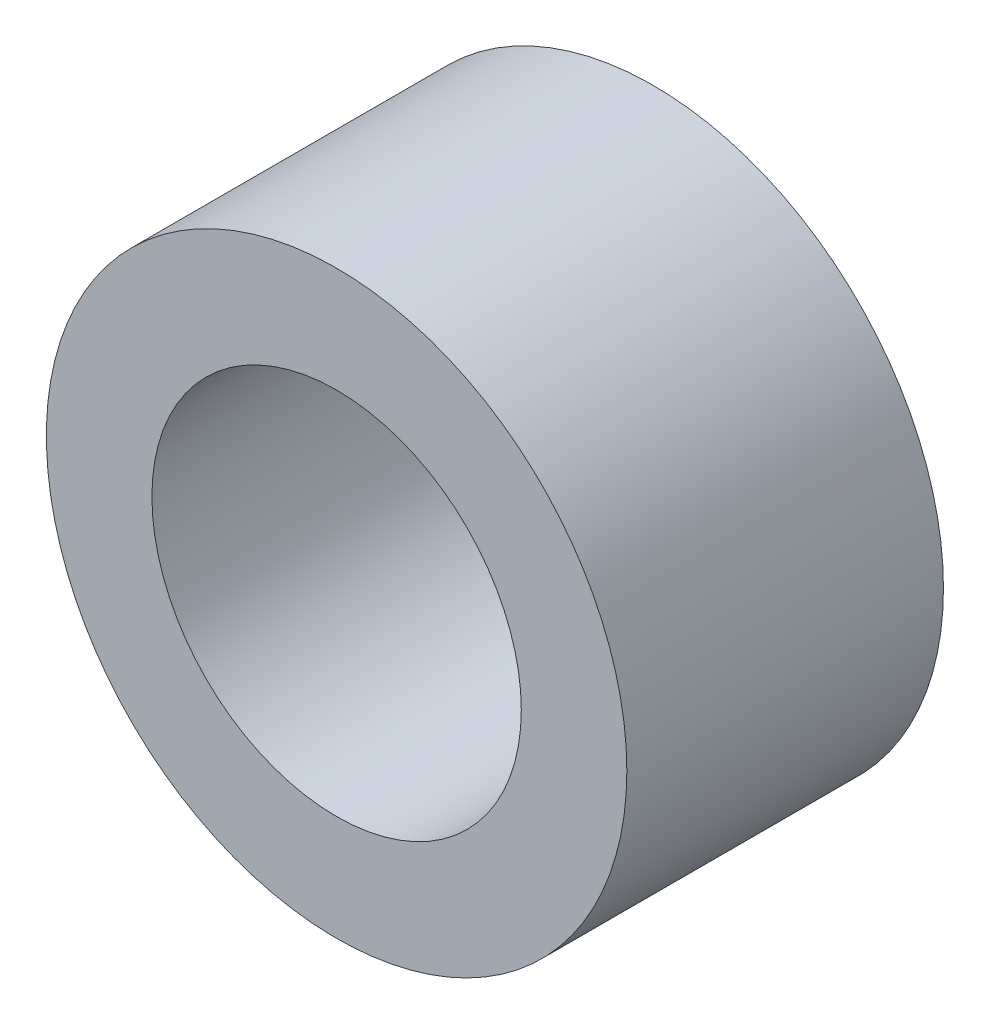
ISO-10303-21;
HEADER;
FILE_DESCRIPTION(('STEP AP214'),'2;1');
FILE_NAME('part.step','',(''),(''),'','','');
FILE_SCHEMA(('AUTOMOTIVE_DESIGN { 1 0 10303 214 1 1 1 1 }'));
ENDSEC;
DATA;
#1=APPLICATION_CONTEXT('core data for automotive mechanical design processes');
#2=APPLICATION_PROTOCOL_DEFINITION('international standard','automotive_design',2000,#1);
#3=PRODUCT_CONTEXT('',#1,'mechanical');
#4=PRODUCT('Part','Part','',(#3));
#5=PRODUCT_RELATED_PRODUCT_CATEGORY('part','',(#4));
#6=PRODUCT_DEFINITION_FORMATION('','',#4);
#7=PRODUCT_DEFINITION_CONTEXT('part definition',#1,'design');
#8=PRODUCT_DEFINITION('design','',#6,#7);
#9=PRODUCT_DEFINITION_SHAPE('','',#8);
#10=(LENGTH_UNIT() NAMED_UNIT(*) SI_UNIT(.MILLI.,.METRE.));
#11=(NAMED_UNIT(*) PLANE_ANGLE_UNIT() SI_UNIT($,.RADIAN.));
#12=(NAMED_UNIT(*) SI_UNIT($,.STERADIAN.) SOLID_ANGLE_UNIT());
#13=UNCERTAINTY_MEASURE_WITH_UNIT(LENGTH_MEASURE(1.E-05),#10,'distance_accuracy_value','');
#14=(GEOMETRIC_REPRESENTATION_CONTEXT(3) GLOBAL_UNCERTAINTY_ASSIGNED_CONTEXT((#13)) GLOBAL_UNIT_ASSIGNED_CONTEXT((#10,
#11,#12)) REPRESENTATION_CONTEXT('',''));
#15=CARTESIAN_POINT('',(0.,0.,0.));
#16=DIRECTION('',(0.,0.,1.));
#17=DIRECTION('',(1.,0.,0.));
#18=AXIS2_PLACEMENT_3D('',#15,#16,#17);
#19=CARTESIAN_POINT('',(0.,0.,9.525));
#20=DIRECTION('',(0.,0.,1.));
#21=DIRECTION('',(1.,0.,0.));
#22=AXIS2_PLACEMENT_3D('',#19,#20,#21);
#23=PLANE('',#22);
#24=CARTESIAN_POINT('',(0.,0.,9.525));
#25=DIRECTION('',(0.,0.,1.));
#26=DIRECTION('',(1.,0.,0.));
#27=AXIS2_PLACEMENT_3D('',#24,#25,#26);
#28=CIRCLE('',#27,17.4625);
#29=CARTESIAN_POINT('',(17.4625,0.,9.525));
#30=VERTEX_POINT('',#29);
#31=EDGE_CURVE('E10',#30,#30,#28,.T.);
#32=ORIENTED_EDGE('',*,*,#31,.T.);
#33=EDGE_LOOP('',(#32));
#34=FACE_BOUND('',#33,.T.);
#35=CARTESIAN_POINT('',(0.,0.,9.525));
#36=DIRECTION('',(0.,0.,1.));
#37=DIRECTION('',(1.,0.,0.));
#38=AXIS2_PLACEMENT_3D('',#35,#36,#37);
#39=CIRCLE('',#38,11.1125);
#40=CARTESIAN_POINT('',(11.1125,0.,9.525));
#41=VERTEX_POINT('',#40);
#42=EDGE_CURVE('E46',#41,#41,#39,.T.);
#43=ORIENTED_EDGE('',*,*,#42,.F.);
#44=EDGE_LOOP('',(#43));
#45=FACE_BOUND('',#44,.T.);
#46=ADVANCED_FACE('F35',(#34,#45),#23,.T.);
#47=CARTESIAN_POINT('',(0.,0.,-9.525));
#48=DIRECTION('',(0.,0.,1.));
#49=DIRECTION('',(1.,0.,0.));
#50=AXIS2_PLACEMENT_3D('',#47,#48,#49);
#51=PLANE('',#50);
#52=CARTESIAN_POINT('',(0.,0.,-9.525));
#53=DIRECTION('',(0.,0.,1.));
#54=DIRECTION('',(1.,0.,0.));
#55=AXIS2_PLACEMENT_3D('',#52,#53,#54);
#56=CIRCLE('',#55,17.4625);
#57=CARTESIAN_POINT('',(17.4625,0.,-9.525));
#58=VERTEX_POINT('',#57);
#59=EDGE_CURVE('E39',#58,#58,#56,.T.);
#60=ORIENTED_EDGE('',*,*,#59,.F.);
#61=EDGE_LOOP('',(#60));
#62=FACE_BOUND('',#61,.T.);
#63=CARTESIAN_POINT('',(0.,0.,-9.525));
#64=DIRECTION('',(0.,0.,1.));
#65=DIRECTION('',(1.,0.,0.));
#66=AXIS2_PLACEMENT_3D('',#63,#64,#65);
#67=CIRCLE('',#66,11.1125);
#68=CARTESIAN_POINT('',(11.1125,0.,-9.525));
#69=VERTEX_POINT('',#68);
#70=EDGE_CURVE('E48',#69,#69,#67,.T.);
#71=ORIENTED_EDGE('',*,*,#70,.T.);
#72=EDGE_LOOP('',(#71));
#73=FACE_BOUND('',#72,.T.);
#74=ADVANCED_FACE('F58',(#62,#73),#51,.F.);
#75=CARTESIAN_POINT('',(0.,0.,9.525));
#76=DIRECTION('',(0.,0.,-1.));
#77=DIRECTION('',(-1.,0.,0.));
#78=AXIS2_PLACEMENT_3D('',#75,#76,#77);
#79=CYLINDRICAL_SURFACE('',#78,17.4625);
#80=ORIENTED_EDGE('',*,*,#31,.F.);
#81=EDGE_LOOP('',(#80));
#82=FACE_BOUND('',#81,.T.);
#83=ORIENTED_EDGE('',*,*,#59,.T.);
#84=EDGE_LOOP('',(#83));
#85=FACE_BOUND('',#84,.T.);
#86=ADVANCED_FACE('F37',(#82,#85),#79,.T.);
#87=CARTESIAN_POINT('',(0.,0.,9.525));
#88=DIRECTION('',(0.,0.,-1.));
#89=DIRECTION('',(-1.,0.,0.));
#90=AXIS2_PLACEMENT_3D('',#87,#88,#89);
#91=CYLINDRICAL_SURFACE('',#90,11.1125);
#92=ORIENTED_EDGE('',*,*,#42,.T.);
#93=EDGE_LOOP('',(#92));
#94=FACE_BOUND('',#93,.T.);
#95=ORIENTED_EDGE('',*,*,#70,.F.);
#96=EDGE_LOOP('',(#95));
#97=FACE_BOUND('',#96,.T.);
#98=ADVANCED_FACE('F54',(#94,#97),#91,.F.);
#99=CLOSED_SHELL('',(#46,#74,#86,#98));
#100=MANIFOLD_SOLID_BREP('B2',#99);
#101=ADVANCED_BREP_SHAPE_REPRESENTATION('',(#18,#100),#14);
#102=SHAPE_DEFINITION_REPRESENTATION(#9,#101);
ENDSEC;
END-ISO-10303-21;
